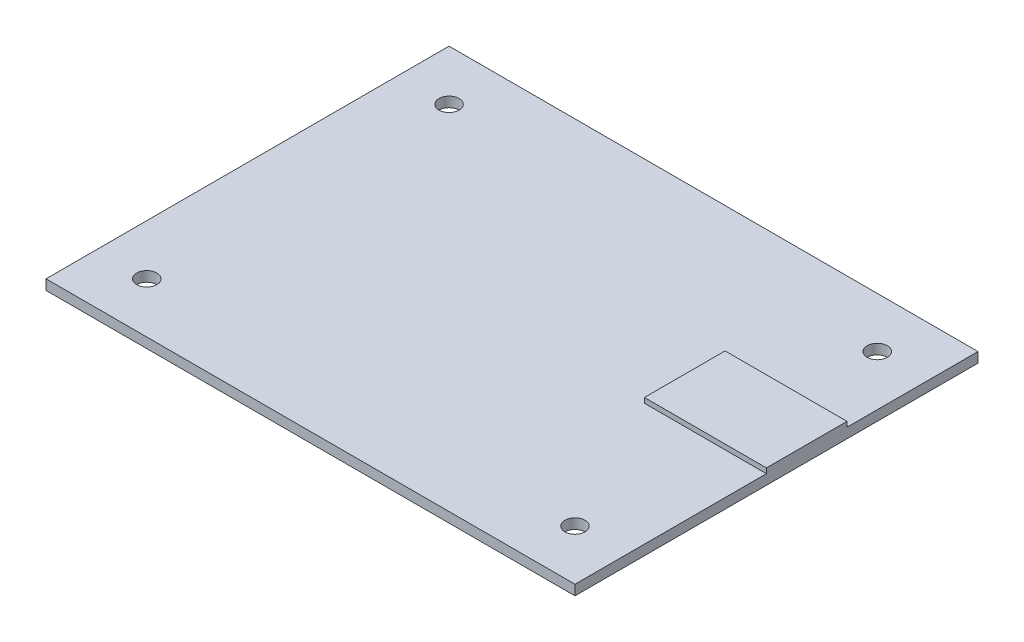
ISO-10303-21;
HEADER;
FILE_DESCRIPTION(('STEP AP214'),'2;1');
FILE_NAME('part.step','',(''),(''),'','','');
FILE_SCHEMA(('AUTOMOTIVE_DESIGN { 1 0 10303 214 1 1 1 1 }'));
ENDSEC;
DATA;
#1=APPLICATION_CONTEXT('core data for automotive mechanical design processes');
#2=APPLICATION_PROTOCOL_DEFINITION('international standard','automotive_design',2000,#1);
#3=PRODUCT_CONTEXT('',#1,'mechanical');
#4=PRODUCT('Part','Part','',(#3));
#5=PRODUCT_RELATED_PRODUCT_CATEGORY('part','',(#4));
#6=PRODUCT_DEFINITION_FORMATION('','',#4);
#7=PRODUCT_DEFINITION_CONTEXT('part definition',#1,'design');
#8=PRODUCT_DEFINITION('design','',#6,#7);
#9=PRODUCT_DEFINITION_SHAPE('','',#8);
#10=(LENGTH_UNIT() NAMED_UNIT(*) SI_UNIT(.MILLI.,.METRE.));
#11=(NAMED_UNIT(*) PLANE_ANGLE_UNIT() SI_UNIT($,.RADIAN.));
#12=(NAMED_UNIT(*) SI_UNIT($,.STERADIAN.) SOLID_ANGLE_UNIT());
#13=UNCERTAINTY_MEASURE_WITH_UNIT(LENGTH_MEASURE(1.E-05),#10,'distance_accuracy_value','');
#14=(GEOMETRIC_REPRESENTATION_CONTEXT(3) GLOBAL_UNCERTAINTY_ASSIGNED_CONTEXT((#13)) GLOBAL_UNIT_ASSIGNED_CONTEXT((#10,
#11,#12)) REPRESENTATION_CONTEXT('',''));
#15=CARTESIAN_POINT('',(0.,0.,0.));
#16=DIRECTION('',(0.,0.,1.));
#17=DIRECTION('',(1.,0.,0.));
#18=AXIS2_PLACEMENT_3D('',#15,#16,#17);
#19=CARTESIAN_POINT('',(0.,2.,0.));
#20=DIRECTION('',(0.,1.,0.));
#21=DIRECTION('',(0.,0.,1.));
#22=AXIS2_PLACEMENT_3D('',#19,#20,#21);
#23=PLANE('',#22);
#24=CARTESIAN_POINT('',(42.5,2.,30.));
#25=DIRECTION('',(0.,1.,0.));
#26=DIRECTION('',(0.,0.,-1.));
#27=AXIS2_PLACEMENT_3D('',#24,#25,#26);
#28=CIRCLE('',#27,1.99999999999996);
#29=CARTESIAN_POINT('',(42.5,2.,28.));
#30=VERTEX_POINT('',#29);
#31=EDGE_CURVE('E169',#30,#30,#28,.T.);
#32=ORIENTED_EDGE('',*,*,#31,.F.);
#33=EDGE_LOOP('',(#32));
#34=FACE_BOUND('',#33,.T.);
#35=CARTESIAN_POINT('',(-42.5,2.,-30.));
#36=DIRECTION('',(0.,1.,0.));
#37=DIRECTION('',(0.,0.,1.));
#38=AXIS2_PLACEMENT_3D('',#35,#36,#37);
#39=CIRCLE('',#38,2.);
#40=CARTESIAN_POINT('',(-42.5,2.,-28.));
#41=VERTEX_POINT('',#40);
#42=EDGE_CURVE('E185',#41,#41,#39,.T.);
#43=ORIENTED_EDGE('',*,*,#42,.F.);
#44=EDGE_LOOP('',(#43));
#45=FACE_BOUND('',#44,.T.);
#46=CARTESIAN_POINT('',(-42.5,2.,30.));
#47=DIRECTION('',(0.,1.,0.));
#48=DIRECTION('',(0.,0.,1.));
#49=AXIS2_PLACEMENT_3D('',#46,#47,#48);
#50=CIRCLE('',#49,2.);
#51=CARTESIAN_POINT('',(-42.5,2.,32.));
#52=VERTEX_POINT('',#51);
#53=EDGE_CURVE('E177',#52,#52,#50,.T.);
#54=ORIENTED_EDGE('',*,*,#53,.F.);
#55=EDGE_LOOP('',(#54));
#56=FACE_BOUND('',#55,.T.);
#57=CARTESIAN_POINT('',(42.5,2.,-30.));
#58=DIRECTION('',(0.,1.,0.));
#59=DIRECTION('',(0.,0.,-1.));
#60=AXIS2_PLACEMENT_3D('',#57,#58,#59);
#61=CIRCLE('',#60,2.00000000000001);
#62=CARTESIAN_POINT('',(42.5,2.,-32.));
#63=VERTEX_POINT('',#62);
#64=EDGE_CURVE('E161',#63,#63,#61,.T.);
#65=ORIENTED_EDGE('',*,*,#64,.F.);
#66=EDGE_LOOP('',(#65));
#67=FACE_BOUND('',#66,.T.);
#68=DIRECTION('',(0.,0.,-1.));
#69=VECTOR('',#68,1.);
#70=CARTESIAN_POINT('',(28.2869676533034,2.,0.));
#71=LINE('',#70,#69);
#72=CARTESIAN_POINT('',(28.2869676533034,2.,2.));
#73=VERTEX_POINT('',#72);
#74=CARTESIAN_POINT('',(28.2869676533034,2.,-14.));
#75=VERTEX_POINT('',#74);
#76=EDGE_CURVE('E156',#73,#75,#71,.T.);
#77=ORIENTED_EDGE('',*,*,#76,.T.);
#78=DIRECTION('',(1.,0.,0.));
#79=VECTOR('',#78,1.);
#80=CARTESIAN_POINT('',(0.,2.,-14.));
#81=LINE('',#80,#79);
#82=CARTESIAN_POINT('',(52.5,2.,-14.));
#83=VERTEX_POINT('',#82);
#84=EDGE_CURVE('E149',#75,#83,#81,.T.);
#85=ORIENTED_EDGE('',*,*,#84,.T.);
#86=DIRECTION('',(0.,0.,-1.));
#87=VECTOR('',#86,1.);
#88=CARTESIAN_POINT('',(52.5,2.,-40.));
#89=LINE('',#88,#87);
#90=CARTESIAN_POINT('',(52.5,2.,-40.));
#91=VERTEX_POINT('',#90);
#92=EDGE_CURVE('E98',#83,#91,#89,.T.);
#93=ORIENTED_EDGE('',*,*,#92,.T.);
#94=DIRECTION('',(-1.,0.,0.));
#95=VECTOR('',#94,1.);
#96=CARTESIAN_POINT('',(-52.5,2.,-40.));
#97=LINE('',#96,#95);
#98=CARTESIAN_POINT('',(-52.5,2.,-40.));
#99=VERTEX_POINT('',#98);
#100=EDGE_CURVE('E196',#91,#99,#97,.T.);
#101=ORIENTED_EDGE('',*,*,#100,.T.);
#102=DIRECTION('',(0.,0.,1.));
#103=VECTOR('',#102,1.);
#104=CARTESIAN_POINT('',(-52.5,2.,-40.));
#105=LINE('',#104,#103);
#106=CARTESIAN_POINT('',(-52.5,2.,40.));
#107=VERTEX_POINT('',#106);
#108=EDGE_CURVE('E199',#99,#107,#105,.T.);
#109=ORIENTED_EDGE('',*,*,#108,.T.);
#110=DIRECTION('',(1.,0.,0.));
#111=VECTOR('',#110,1.);
#112=CARTESIAN_POINT('',(-52.5,2.,40.));
#113=LINE('',#112,#111);
#114=CARTESIAN_POINT('',(52.5,2.,40.));
#115=VERTEX_POINT('',#114);
#116=EDGE_CURVE('E70',#107,#115,#113,.T.);
#117=ORIENTED_EDGE('',*,*,#116,.T.);
#118=CARTESIAN_POINT('',(52.5,2.,1.99999999999999));
#119=VERTEX_POINT('',#118);
#120=EDGE_CURVE('E193',#115,#119,#89,.T.);
#121=ORIENTED_EDGE('',*,*,#120,.T.);
#122=DIRECTION('',(-1.,0.,0.));
#123=VECTOR('',#122,1.);
#124=CARTESIAN_POINT('',(0.,2.,2.));
#125=LINE('',#124,#123);
#126=EDGE_CURVE('E144',#119,#73,#125,.T.);
#127=ORIENTED_EDGE('',*,*,#126,.T.);
#128=EDGE_LOOP('',(#77,#85,#93,#101,#109,#117,#121,#127));
#129=FACE_BOUND('',#128,.T.);
#130=ADVANCED_FACE('F45',(#34,#45,#56,#67,#129),#23,.T.);
#131=CARTESIAN_POINT('',(0.,0.,0.));
#132=DIRECTION('',(0.,1.,0.));
#133=DIRECTION('',(0.,0.,1.));
#134=AXIS2_PLACEMENT_3D('',#131,#132,#133);
#135=PLANE('',#134);
#136=DIRECTION('',(-1.,0.,0.));
#137=VECTOR('',#136,1.);
#138=CARTESIAN_POINT('',(-52.5,0.,-40.));
#139=LINE('',#138,#137);
#140=CARTESIAN_POINT('',(52.5,0.,-40.));
#141=VERTEX_POINT('',#140);
#142=CARTESIAN_POINT('',(-52.5,0.,-40.));
#143=VERTEX_POINT('',#142);
#144=EDGE_CURVE('E207',#141,#143,#139,.T.);
#145=ORIENTED_EDGE('',*,*,#144,.F.);
#146=DIRECTION('',(0.,0.,-1.));
#147=VECTOR('',#146,1.);
#148=CARTESIAN_POINT('',(52.5,0.,-40.));
#149=LINE('',#148,#147);
#150=CARTESIAN_POINT('',(52.5,0.,40.));
#151=VERTEX_POINT('',#150);
#152=EDGE_CURVE('E189',#151,#141,#149,.T.);
#153=ORIENTED_EDGE('',*,*,#152,.F.);
#154=DIRECTION('',(1.,0.,0.));
#155=VECTOR('',#154,1.);
#156=CARTESIAN_POINT('',(-52.5,0.,40.));
#157=LINE('',#156,#155);
#158=CARTESIAN_POINT('',(-52.5,0.,40.));
#159=VERTEX_POINT('',#158);
#160=EDGE_CURVE('E91',#159,#151,#157,.T.);
#161=ORIENTED_EDGE('',*,*,#160,.F.);
#162=DIRECTION('',(0.,0.,1.));
#163=VECTOR('',#162,1.);
#164=CARTESIAN_POINT('',(-52.5,0.,-40.));
#165=LINE('',#164,#163);
#166=EDGE_CURVE('E210',#143,#159,#165,.T.);
#167=ORIENTED_EDGE('',*,*,#166,.F.);
#168=EDGE_LOOP('',(#145,#153,#161,#167));
#169=FACE_BOUND('',#168,.T.);
#170=CARTESIAN_POINT('',(42.5,0.,-30.));
#171=DIRECTION('',(0.,1.,0.));
#172=DIRECTION('',(0.,0.,-1.));
#173=AXIS2_PLACEMENT_3D('',#170,#171,#172);
#174=CIRCLE('',#173,2.00000000000001);
#175=CARTESIAN_POINT('',(42.5,0.,-32.));
#176=VERTEX_POINT('',#175);
#177=EDGE_CURVE('E160',#176,#176,#174,.T.);
#178=ORIENTED_EDGE('',*,*,#177,.T.);
#179=EDGE_LOOP('',(#178));
#180=FACE_BOUND('',#179,.T.);
#181=CARTESIAN_POINT('',(42.5,0.,30.));
#182=DIRECTION('',(0.,1.,0.));
#183=DIRECTION('',(0.,0.,-1.));
#184=AXIS2_PLACEMENT_3D('',#181,#182,#183);
#185=CIRCLE('',#184,1.99999999999996);
#186=CARTESIAN_POINT('',(42.5,0.,28.));
#187=VERTEX_POINT('',#186);
#188=EDGE_CURVE('E165',#187,#187,#185,.T.);
#189=ORIENTED_EDGE('',*,*,#188,.T.);
#190=EDGE_LOOP('',(#189));
#191=FACE_BOUND('',#190,.T.);
#192=CARTESIAN_POINT('',(-42.5,0.,30.));
#193=DIRECTION('',(0.,1.,0.));
#194=DIRECTION('',(0.,0.,1.));
#195=AXIS2_PLACEMENT_3D('',#192,#193,#194);
#196=CIRCLE('',#195,2.);
#197=CARTESIAN_POINT('',(-42.5,0.,32.));
#198=VERTEX_POINT('',#197);
#199=EDGE_CURVE('E173',#198,#198,#196,.T.);
#200=ORIENTED_EDGE('',*,*,#199,.T.);
#201=EDGE_LOOP('',(#200));
#202=FACE_BOUND('',#201,.T.);
#203=CARTESIAN_POINT('',(-42.5,0.,-30.));
#204=DIRECTION('',(0.,1.,0.));
#205=DIRECTION('',(0.,0.,1.));
#206=AXIS2_PLACEMENT_3D('',#203,#204,#205);
#207=CIRCLE('',#206,2.);
#208=CARTESIAN_POINT('',(-42.5,0.,-28.));
#209=VERTEX_POINT('',#208);
#210=EDGE_CURVE('E181',#209,#209,#207,.T.);
#211=ORIENTED_EDGE('',*,*,#210,.T.);
#212=EDGE_LOOP('',(#211));
#213=FACE_BOUND('',#212,.T.);
#214=ADVANCED_FACE('F230',(#169,#180,#191,#202,#213),#135,.F.);
#215=CARTESIAN_POINT('',(52.5,2.,-40.));
#216=DIRECTION('',(-1.,0.,0.));
#217=DIRECTION('',(0.,0.,1.));
#218=AXIS2_PLACEMENT_3D('',#215,#216,#217);
#219=PLANE('',#218);
#220=ORIENTED_EDGE('',*,*,#152,.T.);
#221=DIRECTION('',(0.,-1.,0.));
#222=VECTOR('',#221,1.);
#223=CARTESIAN_POINT('',(52.5,2.,-40.));
#224=LINE('',#223,#222);
#225=EDGE_CURVE('E11',#91,#141,#224,.T.);
#226=ORIENTED_EDGE('',*,*,#225,.F.);
#227=ORIENTED_EDGE('',*,*,#92,.F.);
#228=DIRECTION('',(0.,-1.,0.));
#229=VECTOR('',#228,1.);
#230=CARTESIAN_POINT('',(52.5,3.,-14.));
#231=LINE('',#230,#229);
#232=CARTESIAN_POINT('',(52.5,3.,-14.));
#233=VERTEX_POINT('',#232);
#234=EDGE_CURVE('E125',#233,#83,#231,.T.);
#235=ORIENTED_EDGE('',*,*,#234,.F.);
#236=DIRECTION('',(0.,0.,-1.));
#237=VECTOR('',#236,1.);
#238=CARTESIAN_POINT('',(52.5,3.,1.99999999999999));
#239=LINE('',#238,#237);
#240=CARTESIAN_POINT('',(52.5,3.,1.99999999999999));
#241=VERTEX_POINT('',#240);
#242=EDGE_CURVE('E132',#241,#233,#239,.T.);
#243=ORIENTED_EDGE('',*,*,#242,.F.);
#244=DIRECTION('',(0.,-1.,0.));
#245=VECTOR('',#244,1.);
#246=CARTESIAN_POINT('',(52.5,3.,1.99999999999999));
#247=LINE('',#246,#245);
#248=EDGE_CURVE('E398',#241,#119,#247,.T.);
#249=ORIENTED_EDGE('',*,*,#248,.T.);
#250=ORIENTED_EDGE('',*,*,#120,.F.);
#251=DIRECTION('',(0.,-1.,0.));
#252=VECTOR('',#251,1.);
#253=CARTESIAN_POINT('',(52.5,2.,40.));
#254=LINE('',#253,#252);
#255=EDGE_CURVE('E204',#115,#151,#254,.T.);
#256=ORIENTED_EDGE('',*,*,#255,.T.);
#257=EDGE_LOOP('',(#220,#226,#227,#235,#243,#249,#250,#256));
#258=FACE_BOUND('',#257,.T.);
#259=ADVANCED_FACE('F47',(#258),#219,.F.);
#260=CARTESIAN_POINT('',(-52.5,2.,-40.));
#261=DIRECTION('',(0.,0.,1.));
#262=DIRECTION('',(1.,0.,0.));
#263=AXIS2_PLACEMENT_3D('',#260,#261,#262);
#264=PLANE('',#263);
#265=ORIENTED_EDGE('',*,*,#144,.T.);
#266=DIRECTION('',(0.,-1.,0.));
#267=VECTOR('',#266,1.);
#268=CARTESIAN_POINT('',(-52.5,2.,-40.));
#269=LINE('',#268,#267);
#270=EDGE_CURVE('E54',#99,#143,#269,.T.);
#271=ORIENTED_EDGE('',*,*,#270,.F.);
#272=ORIENTED_EDGE('',*,*,#100,.F.);
#273=ORIENTED_EDGE('',*,*,#225,.T.);
#274=EDGE_LOOP('',(#265,#271,#272,#273));
#275=FACE_BOUND('',#274,.T.);
#276=ADVANCED_FACE('F245',(#275),#264,.F.);
#277=CARTESIAN_POINT('',(-52.5,2.,-40.));
#278=DIRECTION('',(1.,0.,0.));
#279=DIRECTION('',(0.,0.,-1.));
#280=AXIS2_PLACEMENT_3D('',#277,#278,#279);
#281=PLANE('',#280);
#282=ORIENTED_EDGE('',*,*,#166,.T.);
#283=DIRECTION('',(0.,-1.,0.));
#284=VECTOR('',#283,1.);
#285=CARTESIAN_POINT('',(-52.5,2.,40.));
#286=LINE('',#285,#284);
#287=EDGE_CURVE('E217',#107,#159,#286,.T.);
#288=ORIENTED_EDGE('',*,*,#287,.F.);
#289=ORIENTED_EDGE('',*,*,#108,.F.);
#290=ORIENTED_EDGE('',*,*,#270,.T.);
#291=EDGE_LOOP('',(#282,#288,#289,#290));
#292=FACE_BOUND('',#291,.T.);
#293=ADVANCED_FACE('F225',(#292),#281,.F.);
#294=CARTESIAN_POINT('',(-52.5,2.,40.));
#295=DIRECTION('',(0.,0.,-1.));
#296=DIRECTION('',(-1.,0.,0.));
#297=AXIS2_PLACEMENT_3D('',#294,#295,#296);
#298=PLANE('',#297);
#299=ORIENTED_EDGE('',*,*,#160,.T.);
#300=ORIENTED_EDGE('',*,*,#255,.F.);
#301=ORIENTED_EDGE('',*,*,#116,.F.);
#302=ORIENTED_EDGE('',*,*,#287,.T.);
#303=EDGE_LOOP('',(#299,#300,#301,#302));
#304=FACE_BOUND('',#303,.T.);
#305=ADVANCED_FACE('F234',(#304),#298,.F.);
#306=CARTESIAN_POINT('',(-42.5,2.,-30.));
#307=DIRECTION('',(0.,-1.,0.));
#308=DIRECTION('',(0.,0.,-1.));
#309=AXIS2_PLACEMENT_3D('',#306,#307,#308);
#310=CYLINDRICAL_SURFACE('',#309,2.);
#311=ORIENTED_EDGE('',*,*,#42,.T.);
#312=EDGE_LOOP('',(#311));
#313=FACE_BOUND('',#312,.T.);
#314=ORIENTED_EDGE('',*,*,#210,.F.);
#315=EDGE_LOOP('',(#314));
#316=FACE_BOUND('',#315,.T.);
#317=ADVANCED_FACE('F236',(#313,#316),#310,.F.);
#318=CARTESIAN_POINT('',(-42.5,2.,30.));
#319=DIRECTION('',(0.,-1.,0.));
#320=DIRECTION('',(0.,0.,-1.));
#321=AXIS2_PLACEMENT_3D('',#318,#319,#320);
#322=CYLINDRICAL_SURFACE('',#321,2.);
#323=ORIENTED_EDGE('',*,*,#53,.T.);
#324=EDGE_LOOP('',(#323));
#325=FACE_BOUND('',#324,.T.);
#326=ORIENTED_EDGE('',*,*,#199,.F.);
#327=EDGE_LOOP('',(#326));
#328=FACE_BOUND('',#327,.T.);
#329=ADVANCED_FACE('F242',(#325,#328),#322,.F.);
#330=CARTESIAN_POINT('',(42.5,2.,30.));
#331=DIRECTION('',(0.,-1.,0.));
#332=DIRECTION('',(0.,0.,-1.));
#333=AXIS2_PLACEMENT_3D('',#330,#331,#332);
#334=CYLINDRICAL_SURFACE('',#333,1.99999999999996);
#335=ORIENTED_EDGE('',*,*,#31,.T.);
#336=EDGE_LOOP('',(#335));
#337=FACE_BOUND('',#336,.T.);
#338=ORIENTED_EDGE('',*,*,#188,.F.);
#339=EDGE_LOOP('',(#338));
#340=FACE_BOUND('',#339,.T.);
#341=ADVANCED_FACE('F259',(#337,#340),#334,.F.);
#342=CARTESIAN_POINT('',(42.5,2.,-30.));
#343=DIRECTION('',(0.,-1.,0.));
#344=DIRECTION('',(0.,0.,-1.));
#345=AXIS2_PLACEMENT_3D('',#342,#343,#344);
#346=CYLINDRICAL_SURFACE('',#345,2.00000000000001);
#347=ORIENTED_EDGE('',*,*,#64,.T.);
#348=EDGE_LOOP('',(#347));
#349=FACE_BOUND('',#348,.T.);
#350=ORIENTED_EDGE('',*,*,#177,.F.);
#351=EDGE_LOOP('',(#350));
#352=FACE_BOUND('',#351,.T.);
#353=ADVANCED_FACE('F263',(#349,#352),#346,.F.);
#354=CARTESIAN_POINT('',(52.5,3.,-14.));
#355=DIRECTION('',(0.,0.,1.));
#356=DIRECTION('',(1.,0.,0.));
#357=AXIS2_PLACEMENT_3D('',#354,#355,#356);
#358=PLANE('',#357);
#359=ORIENTED_EDGE('',*,*,#84,.F.);
#360=DIRECTION('',(0.,-1.,0.));
#361=VECTOR('',#360,1.);
#362=CARTESIAN_POINT('',(28.2869676533034,3.,-14.));
#363=LINE('',#362,#361);
#364=CARTESIAN_POINT('',(28.2869676533034,3.,-14.));
#365=VERTEX_POINT('',#364);
#366=EDGE_CURVE('E127',#365,#75,#363,.T.);
#367=ORIENTED_EDGE('',*,*,#366,.F.);
#368=DIRECTION('',(-1.,0.,0.));
#369=VECTOR('',#368,1.);
#370=CARTESIAN_POINT('',(52.5,3.,-14.));
#371=LINE('',#370,#369);
#372=EDGE_CURVE('E121',#233,#365,#371,.T.);
#373=ORIENTED_EDGE('',*,*,#372,.F.);
#374=ORIENTED_EDGE('',*,*,#234,.T.);
#375=EDGE_LOOP('',(#359,#367,#373,#374));
#376=FACE_BOUND('',#375,.T.);
#377=ADVANCED_FACE('F123',(#376),#358,.F.);
#378=CARTESIAN_POINT('',(28.2869676533034,3.,2.));
#379=DIRECTION('',(1.,0.,0.));
#380=DIRECTION('',(0.,0.,-1.));
#381=AXIS2_PLACEMENT_3D('',#378,#379,#380);
#382=PLANE('',#381);
#383=ORIENTED_EDGE('',*,*,#76,.F.);
#384=DIRECTION('',(0.,-1.,0.));
#385=VECTOR('',#384,1.);
#386=CARTESIAN_POINT('',(28.2869676533034,3.,2.));
#387=LINE('',#386,#385);
#388=CARTESIAN_POINT('',(28.2869676533034,3.,2.));
#389=VERTEX_POINT('',#388);
#390=EDGE_CURVE('E61',#389,#73,#387,.T.);
#391=ORIENTED_EDGE('',*,*,#390,.F.);
#392=DIRECTION('',(0.,0.,1.));
#393=VECTOR('',#392,1.);
#394=CARTESIAN_POINT('',(28.2869676533034,3.,2.));
#395=LINE('',#394,#393);
#396=EDGE_CURVE('E131',#365,#389,#395,.T.);
#397=ORIENTED_EDGE('',*,*,#396,.F.);
#398=ORIENTED_EDGE('',*,*,#366,.T.);
#399=EDGE_LOOP('',(#383,#391,#397,#398));
#400=FACE_BOUND('',#399,.T.);
#401=ADVANCED_FACE('F270',(#400),#382,.F.);
#402=CARTESIAN_POINT('',(52.5,3.,1.99999999999999));
#403=DIRECTION('',(0.,0.,-1.));
#404=DIRECTION('',(-1.,0.,0.));
#405=AXIS2_PLACEMENT_3D('',#402,#403,#404);
#406=PLANE('',#405);
#407=ORIENTED_EDGE('',*,*,#126,.F.);
#408=ORIENTED_EDGE('',*,*,#248,.F.);
#409=DIRECTION('',(1.,0.,0.));
#410=VECTOR('',#409,1.);
#411=CARTESIAN_POINT('',(52.5,3.,1.99999999999999));
#412=LINE('',#411,#410);
#413=EDGE_CURVE('E136',#389,#241,#412,.T.);
#414=ORIENTED_EDGE('',*,*,#413,.F.);
#415=ORIENTED_EDGE('',*,*,#390,.T.);
#416=EDGE_LOOP('',(#407,#408,#414,#415));
#417=FACE_BOUND('',#416,.T.);
#418=ADVANCED_FACE('F273',(#417),#406,.F.);
#419=CARTESIAN_POINT('',(0.,3.,0.));
#420=DIRECTION('',(0.,1.,0.));
#421=DIRECTION('',(0.,0.,1.));
#422=AXIS2_PLACEMENT_3D('',#419,#420,#421);
#423=PLANE('',#422);
#424=ORIENTED_EDGE('',*,*,#242,.T.);
#425=ORIENTED_EDGE('',*,*,#372,.T.);
#426=ORIENTED_EDGE('',*,*,#396,.T.);
#427=ORIENTED_EDGE('',*,*,#413,.T.);
#428=EDGE_LOOP('',(#424,#425,#426,#427));
#429=FACE_BOUND('',#428,.T.);
#430=ADVANCED_FACE('F135',(#429),#423,.T.);
#431=CLOSED_SHELL('',(#130,#214,#259,#276,#293,#305,#317,#329,#341,#353,#377,#401,#418,#430));
#432=MANIFOLD_SOLID_BREP('B2',#431);
#433=ADVANCED_BREP_SHAPE_REPRESENTATION('',(#18,#432),#14);
#434=SHAPE_DEFINITION_REPRESENTATION(#9,#433);
ENDSEC;
END-ISO-10303-21;
